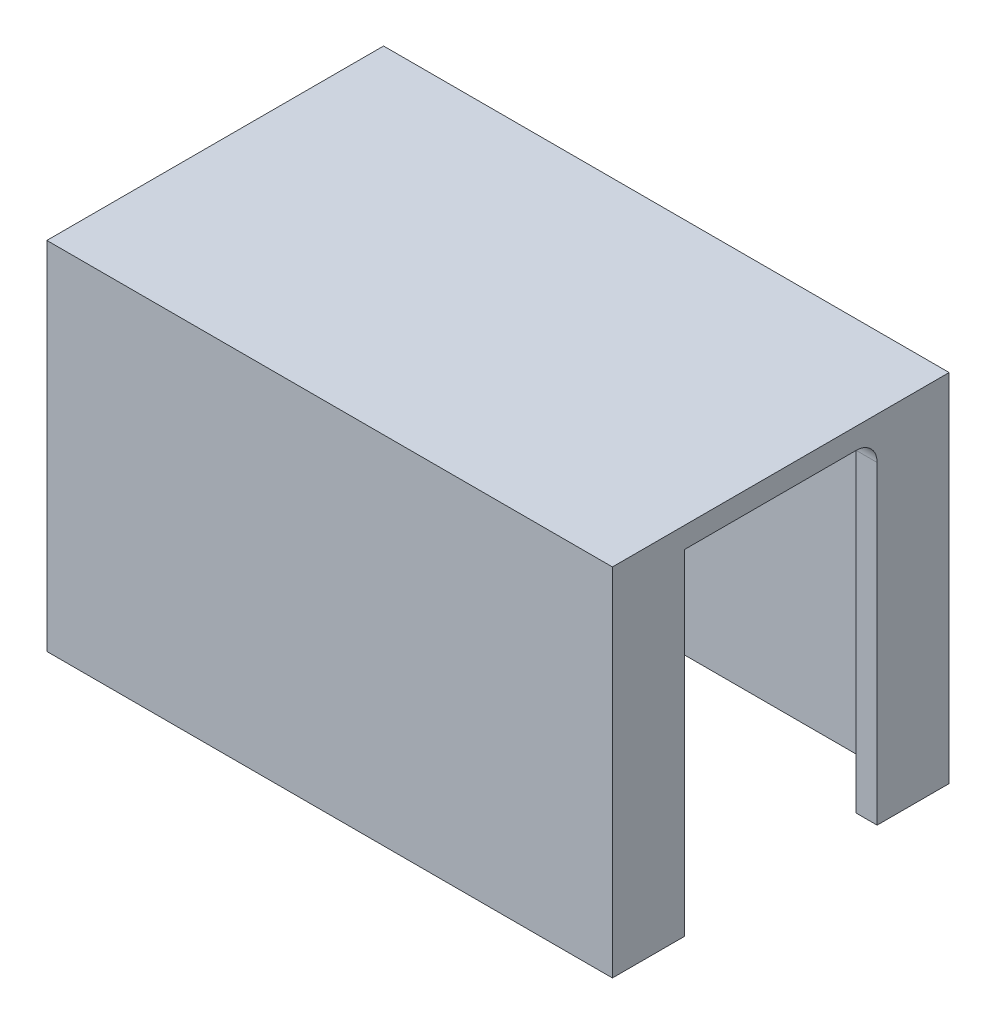
ISO-10303-21;
HEADER;
FILE_DESCRIPTION(('STEP AP214'),'2;1');
FILE_NAME('part.step','',(''),(''),'','','');
FILE_SCHEMA(('AUTOMOTIVE_DESIGN { 1 0 10303 214 1 1 1 1 }'));
ENDSEC;
DATA;
#1=APPLICATION_CONTEXT('core data for automotive mechanical design processes');
#2=APPLICATION_PROTOCOL_DEFINITION('international standard','automotive_design',2000,#1);
#3=PRODUCT_CONTEXT('',#1,'mechanical');
#4=PRODUCT('Part','Part','',(#3));
#5=PRODUCT_RELATED_PRODUCT_CATEGORY('part','',(#4));
#6=PRODUCT_DEFINITION_FORMATION('','',#4);
#7=PRODUCT_DEFINITION_CONTEXT('part definition',#1,'design');
#8=PRODUCT_DEFINITION('design','',#6,#7);
#9=PRODUCT_DEFINITION_SHAPE('','',#8);
#10=(LENGTH_UNIT() NAMED_UNIT(*) SI_UNIT(.MILLI.,.METRE.));
#11=(NAMED_UNIT(*) PLANE_ANGLE_UNIT() SI_UNIT($,.RADIAN.));
#12=(NAMED_UNIT(*) SI_UNIT($,.STERADIAN.) SOLID_ANGLE_UNIT());
#13=UNCERTAINTY_MEASURE_WITH_UNIT(LENGTH_MEASURE(1.E-05),#10,'distance_accuracy_value','');
#14=(GEOMETRIC_REPRESENTATION_CONTEXT(3) GLOBAL_UNCERTAINTY_ASSIGNED_CONTEXT((#13)) GLOBAL_UNIT_ASSIGNED_CONTEXT((#10,
#11,#12)) REPRESENTATION_CONTEXT('',''));
#15=CARTESIAN_POINT('',(0.,0.,0.));
#16=DIRECTION('',(0.,0.,1.));
#17=DIRECTION('',(1.,0.,0.));
#18=AXIS2_PLACEMENT_3D('',#15,#16,#17);
#19=CARTESIAN_POINT('',(85.7504,0.,40.132));
#20=DIRECTION('',(0.,0.,1.));
#21=DIRECTION('',(1.,0.,0.));
#22=AXIS2_PLACEMENT_3D('',#19,#20,#21);
#23=PLANE('',#22);
#24=DIRECTION('',(-1.,0.,0.));
#25=VECTOR('',#24,1.);
#26=CARTESIAN_POINT('',(85.7504,0.,40.132));
#27=LINE('',#26,#25);
#28=CARTESIAN_POINT('',(85.7504,0.,40.132));
#29=VERTEX_POINT('',#28);
#30=CARTESIAN_POINT('',(82.5754,0.,40.132));
#31=VERTEX_POINT('',#30);
#32=EDGE_CURVE('E252',#29,#31,#27,.T.);
#33=ORIENTED_EDGE('',*,*,#32,.T.);
#34=DIRECTION('',(0.,-1.,0.));
#35=VECTOR('',#34,1.);
#36=CARTESIAN_POINT('',(82.5754,50.8,40.132));
#37=LINE('',#36,#35);
#38=CARTESIAN_POINT('',(82.5754,50.8,40.132));
#39=VERTEX_POINT('',#38);
#40=EDGE_CURVE('E210',#39,#31,#37,.T.);
#41=ORIENTED_EDGE('',*,*,#40,.F.);
#42=DIRECTION('',(-1.,0.,0.));
#43=VECTOR('',#42,1.);
#44=CARTESIAN_POINT('',(85.7504,50.8,40.132));
#45=LINE('',#44,#43);
#46=CARTESIAN_POINT('',(85.7504,50.8,40.132));
#47=VERTEX_POINT('',#46);
#48=EDGE_CURVE('E200',#47,#39,#45,.T.);
#49=ORIENTED_EDGE('',*,*,#48,.F.);
#50=DIRECTION('',(0.,1.,0.));
#51=VECTOR('',#50,1.);
#52=CARTESIAN_POINT('',(85.7504,0.,40.132));
#53=LINE('',#52,#51);
#54=EDGE_CURVE('E230',#29,#47,#53,.T.);
#55=ORIENTED_EDGE('',*,*,#54,.F.);
#56=EDGE_LOOP('',(#33,#41,#49,#55));
#57=FACE_BOUND('',#56,.T.);
#58=ADVANCED_FACE('F37',(#57),#23,.F.);
#59=CARTESIAN_POINT('',(85.7504,50.8,10.922));
#60=DIRECTION('',(0.,0.,-1.));
#61=DIRECTION('',(-1.,0.,0.));
#62=AXIS2_PLACEMENT_3D('',#59,#60,#61);
#63=PLANE('',#62);
#64=DIRECTION('',(0.,-1.,0.));
#65=VECTOR('',#64,1.);
#66=CARTESIAN_POINT('',(85.7504,50.8,10.922));
#67=LINE('',#66,#65);
#68=CARTESIAN_POINT('',(85.7504,47.625,10.922));
#69=VERTEX_POINT('',#68);
#70=CARTESIAN_POINT('',(85.7504,0.,10.922));
#71=VERTEX_POINT('',#70);
#72=EDGE_CURVE('E236',#69,#71,#67,.T.);
#73=ORIENTED_EDGE('',*,*,#72,.F.);
#74=DIRECTION('',(-1.,0.,0.));
#75=VECTOR('',#74,1.);
#76=CARTESIAN_POINT('',(79.4004,47.625,10.922));
#77=LINE('',#76,#75);
#78=CARTESIAN_POINT('',(82.5754,47.625,10.922));
#79=VERTEX_POINT('',#78);
#80=EDGE_CURVE('E335',#69,#79,#77,.T.);
#81=ORIENTED_EDGE('',*,*,#80,.T.);
#82=DIRECTION('',(0.,1.,0.));
#83=VECTOR('',#82,1.);
#84=CARTESIAN_POINT('',(82.5754,0.,10.922));
#85=LINE('',#84,#83);
#86=CARTESIAN_POINT('',(82.5754,0.,10.922));
#87=VERTEX_POINT('',#86);
#88=EDGE_CURVE('E221',#87,#79,#85,.T.);
#89=ORIENTED_EDGE('',*,*,#88,.F.);
#90=DIRECTION('',(-1.,0.,0.));
#91=VECTOR('',#90,1.);
#92=CARTESIAN_POINT('',(85.7504,0.,10.922));
#93=LINE('',#92,#91);
#94=EDGE_CURVE('E245',#71,#87,#93,.T.);
#95=ORIENTED_EDGE('',*,*,#94,.F.);
#96=EDGE_LOOP('',(#73,#81,#89,#95));
#97=FACE_BOUND('',#96,.T.);
#98=ADVANCED_FACE('F354',(#97),#63,.F.);
#99=CARTESIAN_POINT('',(85.7504,0.,51.054));
#100=DIRECTION('',(0.,-1.,0.));
#101=DIRECTION('',(1.,0.,0.));
#102=AXIS2_PLACEMENT_3D('',#99,#100,#101);
#103=PLANE('',#102);
#104=DIRECTION('',(0.,0.,1.));
#105=VECTOR('',#104,1.);
#106=CARTESIAN_POINT('',(82.5754,0.,3.17499999999999));
#107=LINE('',#106,#105);
#108=CARTESIAN_POINT('',(82.5754,0.,6.34999999999999));
#109=VERTEX_POINT('',#108);
#110=EDGE_CURVE('E225',#109,#87,#107,.T.);
#111=ORIENTED_EDGE('',*,*,#110,.F.);
#112=CARTESIAN_POINT('',(79.4004,0.,6.34999999999999));
#113=DIRECTION('',(0.,-1.,0.));
#114=DIRECTION('',(1.,0.,0.));
#115=AXIS2_PLACEMENT_3D('',#112,#113,#114);
#116=CIRCLE('',#115,3.175);
#117=CARTESIAN_POINT('',(79.4004,0.,3.17499999999999));
#118=VERTEX_POINT('',#117);
#119=EDGE_CURVE('E333',#109,#118,#116,.F.);
#120=ORIENTED_EDGE('',*,*,#119,.T.);
#121=DIRECTION('',(1.,0.,0.));
#122=VECTOR('',#121,1.);
#123=CARTESIAN_POINT('',(3.175,0.,3.17499999999999));
#124=LINE('',#123,#122);
#125=CARTESIAN_POINT('',(6.35,0.,3.17499999999999));
#126=VERTEX_POINT('',#125);
#127=EDGE_CURVE('E217',#126,#118,#124,.T.);
#128=ORIENTED_EDGE('',*,*,#127,.F.);
#129=CARTESIAN_POINT('',(6.35,0.,6.34999999999999));
#130=DIRECTION('',(0.,-1.,0.));
#131=DIRECTION('',(1.,0.,0.));
#132=AXIS2_PLACEMENT_3D('',#129,#130,#131);
#133=CIRCLE('',#132,3.175);
#134=CARTESIAN_POINT('',(3.175,0.,6.34999999999999));
#135=VERTEX_POINT('',#134);
#136=EDGE_CURVE('E295',#126,#135,#133,.F.);
#137=ORIENTED_EDGE('',*,*,#136,.T.);
#138=DIRECTION('',(0.,0.,1.));
#139=VECTOR('',#138,1.);
#140=CARTESIAN_POINT('',(3.175,0.,3.17499999999999));
#141=LINE('',#140,#139);
#142=CARTESIAN_POINT('',(3.175,0.,10.922));
#143=VERTEX_POINT('',#142);
#144=EDGE_CURVE('E220',#135,#143,#141,.T.);
#145=ORIENTED_EDGE('',*,*,#144,.T.);
#146=CARTESIAN_POINT('',(0.,0.,10.922));
#147=VERTEX_POINT('',#146);
#148=EDGE_CURVE('E249',#143,#147,#93,.T.);
#149=ORIENTED_EDGE('',*,*,#148,.T.);
#150=DIRECTION('',(0.,0.,-1.));
#151=VECTOR('',#150,1.);
#152=CARTESIAN_POINT('',(0.,0.,51.054));
#153=LINE('',#152,#151);
#154=CARTESIAN_POINT('',(0.,0.,0.));
#155=VERTEX_POINT('',#154);
#156=EDGE_CURVE('E287',#147,#155,#153,.T.);
#157=ORIENTED_EDGE('',*,*,#156,.T.);
#158=DIRECTION('',(-1.,0.,0.));
#159=VECTOR('',#158,1.);
#160=CARTESIAN_POINT('',(85.7504,0.,0.));
#161=LINE('',#160,#159);
#162=CARTESIAN_POINT('',(85.7504,0.,0.));
#163=VERTEX_POINT('',#162);
#164=EDGE_CURVE('E271',#163,#155,#161,.T.);
#165=ORIENTED_EDGE('',*,*,#164,.F.);
#166=DIRECTION('',(0.,0.,-1.));
#167=VECTOR('',#166,1.);
#168=CARTESIAN_POINT('',(85.7504,0.,51.054));
#169=LINE('',#168,#167);
#170=EDGE_CURVE('E268',#71,#163,#169,.T.);
#171=ORIENTED_EDGE('',*,*,#170,.F.);
#172=ORIENTED_EDGE('',*,*,#94,.T.);
#173=EDGE_LOOP('',(#111,#120,#128,#137,#145,#149,#157,#165,#171,#172));
#174=FACE_BOUND('',#173,.T.);
#175=ADVANCED_FACE('F360',(#174),#103,.T.);
#176=CARTESIAN_POINT('',(85.7504,53.975,51.054));
#177=DIRECTION('',(1.,0.,0.));
#178=DIRECTION('',(0.,0.,-1.));
#179=AXIS2_PLACEMENT_3D('',#176,#177,#178);
#180=PLANE('',#179);
#181=DIRECTION('',(0.,0.,-1.));
#182=VECTOR('',#181,1.);
#183=CARTESIAN_POINT('',(85.7504,50.8,40.132));
#184=LINE('',#183,#182);
#185=CARTESIAN_POINT('',(85.7504,50.8,14.097));
#186=VERTEX_POINT('',#185);
#187=EDGE_CURVE('E233',#47,#186,#184,.T.);
#188=ORIENTED_EDGE('',*,*,#187,.T.);
#189=CARTESIAN_POINT('',(85.7504,47.625,14.097));
#190=DIRECTION('',(1.,0.,0.));
#191=DIRECTION('',(0.,0.,-1.));
#192=AXIS2_PLACEMENT_3D('',#189,#190,#191);
#193=CIRCLE('',#192,3.175);
#194=EDGE_CURVE('E11',#186,#69,#193,.F.);
#195=ORIENTED_EDGE('',*,*,#194,.T.);
#196=ORIENTED_EDGE('',*,*,#72,.T.);
#197=ORIENTED_EDGE('',*,*,#170,.T.);
#198=DIRECTION('',(0.,-1.,0.));
#199=VECTOR('',#198,1.);
#200=CARTESIAN_POINT('',(85.7504,53.975,0.));
#201=LINE('',#200,#199);
#202=CARTESIAN_POINT('',(85.7504,53.975,0.));
#203=VERTEX_POINT('',#202);
#204=EDGE_CURVE('E248',#203,#163,#201,.T.);
#205=ORIENTED_EDGE('',*,*,#204,.F.);
#206=DIRECTION('',(0.,0.,-1.));
#207=VECTOR('',#206,1.);
#208=CARTESIAN_POINT('',(85.7504,53.975,51.054));
#209=LINE('',#208,#207);
#210=CARTESIAN_POINT('',(85.7504,53.975,51.054));
#211=VERTEX_POINT('',#210);
#212=EDGE_CURVE('E279',#211,#203,#209,.T.);
#213=ORIENTED_EDGE('',*,*,#212,.F.);
#214=DIRECTION('',(0.,-1.,0.));
#215=VECTOR('',#214,1.);
#216=CARTESIAN_POINT('',(85.7504,53.975,51.054));
#217=LINE('',#216,#215);
#218=CARTESIAN_POINT('',(85.7504,0.,51.054));
#219=VERTEX_POINT('',#218);
#220=EDGE_CURVE('E255',#211,#219,#217,.T.);
#221=ORIENTED_EDGE('',*,*,#220,.T.);
#222=EDGE_CURVE('E288',#219,#29,#169,.T.);
#223=ORIENTED_EDGE('',*,*,#222,.T.);
#224=ORIENTED_EDGE('',*,*,#54,.T.);
#225=EDGE_LOOP('',(#188,#195,#196,#197,#205,#213,#221,#223,#224));
#226=FACE_BOUND('',#225,.T.);
#227=ADVANCED_FACE('F351',(#226),#180,.T.);
#228=CARTESIAN_POINT('',(0.,53.975,51.054));
#229=DIRECTION('',(0.,1.,0.));
#230=DIRECTION('',(-1.,0.,0.));
#231=AXIS2_PLACEMENT_3D('',#228,#229,#230);
#232=PLANE('',#231);
#233=DIRECTION('',(1.,0.,0.));
#234=VECTOR('',#233,1.);
#235=CARTESIAN_POINT('',(0.,53.975,0.));
#236=LINE('',#235,#234);
#237=CARTESIAN_POINT('',(0.,53.975,0.));
#238=VERTEX_POINT('',#237);
#239=EDGE_CURVE('E259',#238,#203,#236,.T.);
#240=ORIENTED_EDGE('',*,*,#239,.F.);
#241=DIRECTION('',(0.,0.,-1.));
#242=VECTOR('',#241,1.);
#243=CARTESIAN_POINT('',(0.,53.975,51.054));
#244=LINE('',#243,#242);
#245=CARTESIAN_POINT('',(0.,53.975,51.054));
#246=VERTEX_POINT('',#245);
#247=EDGE_CURVE('E282',#246,#238,#244,.T.);
#248=ORIENTED_EDGE('',*,*,#247,.F.);
#249=DIRECTION('',(1.,0.,0.));
#250=VECTOR('',#249,1.);
#251=CARTESIAN_POINT('',(0.,53.975,51.054));
#252=LINE('',#251,#250);
#253=EDGE_CURVE('E265',#246,#211,#252,.T.);
#254=ORIENTED_EDGE('',*,*,#253,.T.);
#255=ORIENTED_EDGE('',*,*,#212,.T.);
#256=EDGE_LOOP('',(#240,#248,#254,#255));
#257=FACE_BOUND('',#256,.T.);
#258=ADVANCED_FACE('F368',(#257),#232,.T.);
#259=CARTESIAN_POINT('',(0.,0.,51.054));
#260=DIRECTION('',(-1.,0.,0.));
#261=DIRECTION('',(0.,-1.,0.));
#262=AXIS2_PLACEMENT_3D('',#259,#260,#261);
#263=PLANE('',#262);
#264=DIRECTION('',(0.,-1.,0.));
#265=VECTOR('',#264,1.);
#266=CARTESIAN_POINT('',(0.,50.8,10.922));
#267=LINE('',#266,#265);
#268=CARTESIAN_POINT('',(0.,47.625,10.922));
#269=VERTEX_POINT('',#268);
#270=EDGE_CURVE('E234',#269,#147,#267,.T.);
#271=ORIENTED_EDGE('',*,*,#270,.F.);
#272=CARTESIAN_POINT('',(0.,47.625,14.097));
#273=DIRECTION('',(-1.,0.,0.));
#274=DIRECTION('',(0.,-1.,0.));
#275=AXIS2_PLACEMENT_3D('',#272,#273,#274);
#276=CIRCLE('',#275,3.175);
#277=CARTESIAN_POINT('',(0.,50.8,14.097));
#278=VERTEX_POINT('',#277);
#279=EDGE_CURVE('E320',#269,#278,#276,.F.);
#280=ORIENTED_EDGE('',*,*,#279,.T.);
#281=DIRECTION('',(0.,0.,-1.));
#282=VECTOR('',#281,1.);
#283=CARTESIAN_POINT('',(0.,50.8,40.132));
#284=LINE('',#283,#282);
#285=CARTESIAN_POINT('',(0.,50.8,40.132));
#286=VERTEX_POINT('',#285);
#287=EDGE_CURVE('E241',#286,#278,#284,.T.);
#288=ORIENTED_EDGE('',*,*,#287,.F.);
#289=DIRECTION('',(0.,1.,0.));
#290=VECTOR('',#289,1.);
#291=CARTESIAN_POINT('',(0.,0.,40.132));
#292=LINE('',#291,#290);
#293=CARTESIAN_POINT('',(0.,0.,40.132));
#294=VERTEX_POINT('',#293);
#295=EDGE_CURVE('E227',#294,#286,#292,.T.);
#296=ORIENTED_EDGE('',*,*,#295,.F.);
#297=CARTESIAN_POINT('',(0.,0.,51.054));
#298=VERTEX_POINT('',#297);
#299=EDGE_CURVE('E284',#298,#294,#153,.T.);
#300=ORIENTED_EDGE('',*,*,#299,.F.);
#301=DIRECTION('',(0.,1.,0.));
#302=VECTOR('',#301,1.);
#303=CARTESIAN_POINT('',(0.,0.,51.054));
#304=LINE('',#303,#302);
#305=EDGE_CURVE('E262',#298,#246,#304,.T.);
#306=ORIENTED_EDGE('',*,*,#305,.T.);
#307=ORIENTED_EDGE('',*,*,#247,.T.);
#308=DIRECTION('',(0.,1.,0.));
#309=VECTOR('',#308,1.);
#310=CARTESIAN_POINT('',(0.,0.,0.));
#311=LINE('',#310,#309);
#312=EDGE_CURVE('E274',#155,#238,#311,.T.);
#313=ORIENTED_EDGE('',*,*,#312,.F.);
#314=ORIENTED_EDGE('',*,*,#156,.F.);
#315=EDGE_LOOP('',(#271,#280,#288,#296,#300,#306,#307,#313,#314));
#316=FACE_BOUND('',#315,.T.);
#317=ADVANCED_FACE('F409',(#316),#263,.T.);
#318=DIRECTION('',(0.,0.,1.));
#319=VECTOR('',#318,1.);
#320=CARTESIAN_POINT('',(82.5754,0.,40.132));
#321=LINE('',#320,#319);
#322=CARTESIAN_POINT('',(82.5754,0.,47.879));
#323=VERTEX_POINT('',#322);
#324=EDGE_CURVE('E186',#31,#323,#321,.T.);
#325=ORIENTED_EDGE('',*,*,#324,.F.);
#326=ORIENTED_EDGE('',*,*,#32,.F.);
#327=ORIENTED_EDGE('',*,*,#222,.F.);
#328=DIRECTION('',(-1.,0.,0.));
#329=VECTOR('',#328,1.);
#330=CARTESIAN_POINT('',(85.7504,0.,51.054));
#331=LINE('',#330,#329);
#332=EDGE_CURVE('E258',#219,#298,#331,.T.);
#333=ORIENTED_EDGE('',*,*,#332,.T.);
#334=ORIENTED_EDGE('',*,*,#299,.T.);
#335=CARTESIAN_POINT('',(3.175,0.,40.132));
#336=VERTEX_POINT('',#335);
#337=EDGE_CURVE('E238',#336,#294,#27,.T.);
#338=ORIENTED_EDGE('',*,*,#337,.F.);
#339=DIRECTION('',(0.,0.,-1.));
#340=VECTOR('',#339,1.);
#341=CARTESIAN_POINT('',(3.17499999999999,0.,47.879));
#342=LINE('',#341,#340);
#343=CARTESIAN_POINT('',(3.17499999999999,0.,47.879));
#344=VERTEX_POINT('',#343);
#345=EDGE_CURVE('E201',#344,#336,#342,.T.);
#346=ORIENTED_EDGE('',*,*,#345,.F.);
#347=DIRECTION('',(-1.,0.,0.));
#348=VECTOR('',#347,1.);
#349=CARTESIAN_POINT('',(82.5754,0.,47.879));
#350=LINE('',#349,#348);
#351=EDGE_CURVE('E203',#323,#344,#350,.T.);
#352=ORIENTED_EDGE('',*,*,#351,.F.);
#353=EDGE_LOOP('',(#325,#326,#327,#333,#334,#338,#346,#352));
#354=FACE_BOUND('',#353,.T.);
#355=ADVANCED_FACE('F376',(#354),#103,.T.);
#356=CARTESIAN_POINT('',(0.,0.,51.054));
#357=DIRECTION('',(0.,0.,-1.));
#358=DIRECTION('',(-1.,0.,0.));
#359=AXIS2_PLACEMENT_3D('',#356,#357,#358);
#360=PLANE('',#359);
#361=ORIENTED_EDGE('',*,*,#220,.F.);
#362=ORIENTED_EDGE('',*,*,#253,.F.);
#363=ORIENTED_EDGE('',*,*,#305,.F.);
#364=ORIENTED_EDGE('',*,*,#332,.F.);
#365=EDGE_LOOP('',(#361,#362,#363,#364));
#366=FACE_BOUND('',#365,.T.);
#367=ADVANCED_FACE('F372',(#366),#360,.F.);
#368=CARTESIAN_POINT('',(0.,0.,0.));
#369=DIRECTION('',(0.,0.,-1.));
#370=DIRECTION('',(-1.,0.,0.));
#371=AXIS2_PLACEMENT_3D('',#368,#369,#370);
#372=PLANE('',#371);
#373=ORIENTED_EDGE('',*,*,#204,.T.);
#374=ORIENTED_EDGE('',*,*,#164,.T.);
#375=ORIENTED_EDGE('',*,*,#312,.T.);
#376=ORIENTED_EDGE('',*,*,#239,.T.);
#377=EDGE_LOOP('',(#373,#374,#375,#376));
#378=FACE_BOUND('',#377,.T.);
#379=ADVANCED_FACE('F365',(#378),#372,.T.);
#380=DIRECTION('',(0.,-1.,0.));
#381=VECTOR('',#380,1.);
#382=CARTESIAN_POINT('',(3.175,50.8,10.922));
#383=LINE('',#382,#381);
#384=CARTESIAN_POINT('',(3.175,47.625,10.922));
#385=VERTEX_POINT('',#384);
#386=EDGE_CURVE('E212',#385,#143,#383,.T.);
#387=ORIENTED_EDGE('',*,*,#386,.F.);
#388=DIRECTION('',(-1.,0.,0.));
#389=VECTOR('',#388,1.);
#390=CARTESIAN_POINT('',(0.,47.625,10.922));
#391=LINE('',#390,#389);
#392=EDGE_CURVE('E308',#385,#269,#391,.T.);
#393=ORIENTED_EDGE('',*,*,#392,.T.);
#394=ORIENTED_EDGE('',*,*,#270,.T.);
#395=ORIENTED_EDGE('',*,*,#148,.F.);
#396=EDGE_LOOP('',(#387,#393,#394,#395));
#397=FACE_BOUND('',#396,.T.);
#398=ADVANCED_FACE('F385',(#397),#63,.F.);
#399=CARTESIAN_POINT('',(85.7504,50.8,40.132));
#400=DIRECTION('',(0.,1.,0.));
#401=DIRECTION('',(-1.,0.,0.));
#402=AXIS2_PLACEMENT_3D('',#399,#400,#401);
#403=PLANE('',#402);
#404=DIRECTION('',(0.,0.,1.));
#405=VECTOR('',#404,1.);
#406=CARTESIAN_POINT('',(79.4004,50.8,10.922));
#407=LINE('',#406,#405);
#408=CARTESIAN_POINT('',(79.4004,50.8,6.34999999999999));
#409=VERTEX_POINT('',#408);
#410=CARTESIAN_POINT('',(79.4004,50.8,14.097));
#411=VERTEX_POINT('',#410);
#412=EDGE_CURVE('E52',#409,#411,#407,.T.);
#413=ORIENTED_EDGE('',*,*,#412,.T.);
#414=DIRECTION('',(-1.,0.,0.));
#415=VECTOR('',#414,1.);
#416=CARTESIAN_POINT('',(85.7504,50.8,14.097));
#417=LINE('',#416,#415);
#418=EDGE_CURVE('E57',#411,#186,#417,.F.);
#419=ORIENTED_EDGE('',*,*,#418,.T.);
#420=ORIENTED_EDGE('',*,*,#187,.F.);
#421=ORIENTED_EDGE('',*,*,#48,.T.);
#422=DIRECTION('',(0.,0.,1.));
#423=VECTOR('',#422,1.);
#424=CARTESIAN_POINT('',(82.5754,50.8,40.132));
#425=LINE('',#424,#423);
#426=CARTESIAN_POINT('',(82.5754,50.8,47.879));
#427=VERTEX_POINT('',#426);
#428=EDGE_CURVE('E183',#39,#427,#425,.T.);
#429=ORIENTED_EDGE('',*,*,#428,.T.);
#430=DIRECTION('',(-1.,0.,0.));
#431=VECTOR('',#430,1.);
#432=CARTESIAN_POINT('',(82.5754,50.8,47.879));
#433=LINE('',#432,#431);
#434=CARTESIAN_POINT('',(3.17499999999999,50.8,47.879));
#435=VERTEX_POINT('',#434);
#436=EDGE_CURVE('E194',#427,#435,#433,.T.);
#437=ORIENTED_EDGE('',*,*,#436,.T.);
#438=DIRECTION('',(0.,0.,-1.));
#439=VECTOR('',#438,1.);
#440=CARTESIAN_POINT('',(3.17499999999999,50.8,47.879));
#441=LINE('',#440,#439);
#442=CARTESIAN_POINT('',(3.175,50.8,40.132));
#443=VERTEX_POINT('',#442);
#444=EDGE_CURVE('E191',#435,#443,#441,.T.);
#445=ORIENTED_EDGE('',*,*,#444,.T.);
#446=EDGE_CURVE('E251',#443,#286,#45,.T.);
#447=ORIENTED_EDGE('',*,*,#446,.T.);
#448=ORIENTED_EDGE('',*,*,#287,.T.);
#449=DIRECTION('',(-1.,0.,0.));
#450=VECTOR('',#449,1.);
#451=CARTESIAN_POINT('',(6.34999999999999,50.8,14.097));
#452=LINE('',#451,#450);
#453=CARTESIAN_POINT('',(6.35,50.8,14.097));
#454=VERTEX_POINT('',#453);
#455=EDGE_CURVE('E317',#278,#454,#452,.F.);
#456=ORIENTED_EDGE('',*,*,#455,.T.);
#457=DIRECTION('',(0.,0.,1.));
#458=VECTOR('',#457,1.);
#459=CARTESIAN_POINT('',(6.35,50.8,6.34999999999999));
#460=LINE('',#459,#458);
#461=CARTESIAN_POINT('',(6.35,50.8,6.34999999999999));
#462=VERTEX_POINT('',#461);
#463=EDGE_CURVE('E299',#454,#462,#460,.F.);
#464=ORIENTED_EDGE('',*,*,#463,.T.);
#465=DIRECTION('',(-1.,0.,0.));
#466=VECTOR('',#465,1.);
#467=CARTESIAN_POINT('',(85.7504,50.8,6.34999999999999));
#468=LINE('',#467,#466);
#469=EDGE_CURVE('E301',#462,#409,#468,.F.);
#470=ORIENTED_EDGE('',*,*,#469,.T.);
#471=EDGE_LOOP('',(#413,#419,#420,#421,#429,#437,#445,#447,#448,#456,#464,#470));
#472=FACE_BOUND('',#471,.T.);
#473=ADVANCED_FACE('F199',(#472),#403,.F.);
#474=ORIENTED_EDGE('',*,*,#446,.F.);
#475=DIRECTION('',(0.,-1.,0.));
#476=VECTOR('',#475,1.);
#477=CARTESIAN_POINT('',(3.175,50.8,40.132));
#478=LINE('',#477,#476);
#479=EDGE_CURVE('E213',#443,#336,#478,.T.);
#480=ORIENTED_EDGE('',*,*,#479,.T.);
#481=ORIENTED_EDGE('',*,*,#337,.T.);
#482=ORIENTED_EDGE('',*,*,#295,.T.);
#483=EDGE_LOOP('',(#474,#480,#481,#482));
#484=FACE_BOUND('',#483,.T.);
#485=ADVANCED_FACE('F380',(#484),#23,.F.);
#486=CARTESIAN_POINT('',(82.5754,0.,3.17499999999999));
#487=DIRECTION('',(1.,0.,0.));
#488=DIRECTION('',(0.,0.,-1.));
#489=AXIS2_PLACEMENT_3D('',#486,#487,#488);
#490=PLANE('',#489);
#491=ORIENTED_EDGE('',*,*,#88,.T.);
#492=DIRECTION('',(0.,0.,1.));
#493=VECTOR('',#492,1.);
#494=CARTESIAN_POINT('',(82.5754,47.625,6.34999999999999));
#495=LINE('',#494,#493);
#496=CARTESIAN_POINT('',(82.5754,47.625,6.34999999999999));
#497=VERTEX_POINT('',#496);
#498=EDGE_CURVE('E327',#79,#497,#495,.F.);
#499=ORIENTED_EDGE('',*,*,#498,.T.);
#500=DIRECTION('',(0.,1.,0.));
#501=VECTOR('',#500,1.);
#502=CARTESIAN_POINT('',(82.5754,0.,6.34999999999999));
#503=LINE('',#502,#501);
#504=EDGE_CURVE('E325',#497,#109,#503,.F.);
#505=ORIENTED_EDGE('',*,*,#504,.T.);
#506=ORIENTED_EDGE('',*,*,#110,.T.);
#507=EDGE_LOOP('',(#491,#499,#505,#506));
#508=FACE_BOUND('',#507,.T.);
#509=ADVANCED_FACE('F389',(#508),#490,.F.);
#510=CARTESIAN_POINT('',(3.175,50.8,3.17499999999999));
#511=DIRECTION('',(-1.,0.,0.));
#512=DIRECTION('',(0.,-1.,0.));
#513=AXIS2_PLACEMENT_3D('',#510,#511,#512);
#514=PLANE('',#513);
#515=DIRECTION('',(0.,-1.,0.));
#516=VECTOR('',#515,1.);
#517=CARTESIAN_POINT('',(3.175,50.8,6.34999999999999));
#518=LINE('',#517,#516);
#519=CARTESIAN_POINT('',(3.175,47.625,6.34999999999999));
#520=VERTEX_POINT('',#519);
#521=EDGE_CURVE('E292',#135,#520,#518,.F.);
#522=ORIENTED_EDGE('',*,*,#521,.T.);
#523=DIRECTION('',(0.,0.,1.));
#524=VECTOR('',#523,1.);
#525=CARTESIAN_POINT('',(3.175,47.625,10.922));
#526=LINE('',#525,#524);
#527=EDGE_CURVE('E305',#520,#385,#526,.T.);
#528=ORIENTED_EDGE('',*,*,#527,.T.);
#529=ORIENTED_EDGE('',*,*,#386,.T.);
#530=ORIENTED_EDGE('',*,*,#144,.F.);
#531=EDGE_LOOP('',(#522,#528,#529,#530));
#532=FACE_BOUND('',#531,.T.);
#533=ADVANCED_FACE('F395',(#532),#514,.F.);
#534=CARTESIAN_POINT('',(0.,0.,3.17499999999999));
#535=DIRECTION('',(0.,0.,1.));
#536=DIRECTION('',(1.,0.,0.));
#537=AXIS2_PLACEMENT_3D('',#534,#535,#536);
#538=PLANE('',#537);
#539=ORIENTED_EDGE('',*,*,#127,.T.);
#540=DIRECTION('',(0.,1.,0.));
#541=VECTOR('',#540,1.);
#542=CARTESIAN_POINT('',(79.4004,0.,3.17499999999999));
#543=LINE('',#542,#541);
#544=CARTESIAN_POINT('',(79.4004,47.625,3.17499999999999));
#545=VERTEX_POINT('',#544);
#546=EDGE_CURVE('E331',#118,#545,#543,.T.);
#547=ORIENTED_EDGE('',*,*,#546,.T.);
#548=DIRECTION('',(-1.,0.,0.));
#549=VECTOR('',#548,1.);
#550=CARTESIAN_POINT('',(0.,47.625,3.17499999999999));
#551=LINE('',#550,#549);
#552=CARTESIAN_POINT('',(6.35,47.625,3.17499999999999));
#553=VERTEX_POINT('',#552);
#554=EDGE_CURVE('E297',#545,#553,#551,.T.);
#555=ORIENTED_EDGE('',*,*,#554,.T.);
#556=DIRECTION('',(0.,-1.,0.));
#557=VECTOR('',#556,1.);
#558=CARTESIAN_POINT('',(6.35,0.,3.17499999999999));
#559=LINE('',#558,#557);
#560=EDGE_CURVE('E281',#553,#126,#559,.T.);
#561=ORIENTED_EDGE('',*,*,#560,.T.);
#562=EDGE_LOOP('',(#539,#547,#555,#561));
#563=FACE_BOUND('',#562,.T.);
#564=ADVANCED_FACE('F450',(#563),#538,.T.);
#565=CARTESIAN_POINT('',(82.5754,50.8,40.132));
#566=DIRECTION('',(1.,0.,0.));
#567=DIRECTION('',(0.,1.,0.));
#568=AXIS2_PLACEMENT_3D('',#565,#566,#567);
#569=PLANE('',#568);
#570=ORIENTED_EDGE('',*,*,#324,.T.);
#571=DIRECTION('',(0.,-1.,0.));
#572=VECTOR('',#571,1.);
#573=CARTESIAN_POINT('',(82.5754,50.8,47.879));
#574=LINE('',#573,#572);
#575=EDGE_CURVE('E179',#427,#323,#574,.T.);
#576=ORIENTED_EDGE('',*,*,#575,.F.);
#577=ORIENTED_EDGE('',*,*,#428,.F.);
#578=ORIENTED_EDGE('',*,*,#40,.T.);
#579=EDGE_LOOP('',(#570,#576,#577,#578));
#580=FACE_BOUND('',#579,.T.);
#581=ADVANCED_FACE('F181',(#580),#569,.F.);
#582=CARTESIAN_POINT('',(3.17499999999999,50.8,47.879));
#583=DIRECTION('',(-1.,0.,0.));
#584=DIRECTION('',(0.,0.,1.));
#585=AXIS2_PLACEMENT_3D('',#582,#583,#584);
#586=PLANE('',#585);
#587=ORIENTED_EDGE('',*,*,#345,.T.);
#588=ORIENTED_EDGE('',*,*,#479,.F.);
#589=ORIENTED_EDGE('',*,*,#444,.F.);
#590=DIRECTION('',(0.,-1.,0.));
#591=VECTOR('',#590,1.);
#592=CARTESIAN_POINT('',(3.17499999999999,50.8,47.879));
#593=LINE('',#592,#591);
#594=EDGE_CURVE('E190',#435,#344,#593,.T.);
#595=ORIENTED_EDGE('',*,*,#594,.T.);
#596=EDGE_LOOP('',(#587,#588,#589,#595));
#597=FACE_BOUND('',#596,.T.);
#598=ADVANCED_FACE('F405',(#597),#586,.F.);
#599=CARTESIAN_POINT('',(82.5754,50.8,47.879));
#600=DIRECTION('',(0.,0.,1.));
#601=DIRECTION('',(1.,0.,0.));
#602=AXIS2_PLACEMENT_3D('',#599,#600,#601);
#603=PLANE('',#602);
#604=ORIENTED_EDGE('',*,*,#351,.T.);
#605=ORIENTED_EDGE('',*,*,#594,.F.);
#606=ORIENTED_EDGE('',*,*,#436,.F.);
#607=ORIENTED_EDGE('',*,*,#575,.T.);
#608=EDGE_LOOP('',(#604,#605,#606,#607));
#609=FACE_BOUND('',#608,.T.);
#610=ADVANCED_FACE('F195',(#609),#603,.F.);
#611=CARTESIAN_POINT('',(6.35,0.,6.34999999999999));
#612=DIRECTION('',(0.,-1.,0.));
#613=DIRECTION('',(1.,0.,0.));
#614=AXIS2_PLACEMENT_3D('',#611,#612,#613);
#615=CYLINDRICAL_SURFACE('',#614,3.175);
#616=ORIENTED_EDGE('',*,*,#560,.F.);
#617=CARTESIAN_POINT('',(6.35,47.625,6.34999999999999));
#618=DIRECTION('',(0.,-1.,0.));
#619=DIRECTION('',(1.,0.,0.));
#620=AXIS2_PLACEMENT_3D('',#617,#618,#619);
#621=CIRCLE('',#620,3.175);
#622=EDGE_CURVE('E303',#553,#520,#621,.F.);
#623=ORIENTED_EDGE('',*,*,#622,.T.);
#624=ORIENTED_EDGE('',*,*,#521,.F.);
#625=ORIENTED_EDGE('',*,*,#136,.F.);
#626=EDGE_LOOP('',(#616,#623,#624,#625));
#627=FACE_BOUND('',#626,.T.);
#628=ADVANCED_FACE('F427',(#627),#615,.F.);
#629=CARTESIAN_POINT('',(6.35,47.625,3.17499999999999));
#630=DIRECTION('',(0.,0.,-1.));
#631=DIRECTION('',(-1.,0.,0.));
#632=AXIS2_PLACEMENT_3D('',#629,#630,#631);
#633=CYLINDRICAL_SURFACE('',#632,3.175);
#634=ORIENTED_EDGE('',*,*,#463,.F.);
#635=CARTESIAN_POINT('',(6.35,47.625,14.097));
#636=DIRECTION('',(0.707106781186547,0.,-0.707106781186547));
#637=DIRECTION('',(-0.707106781186547,0.,-0.707106781186547));
#638=AXIS2_PLACEMENT_3D('',#635,#636,#637);
#639=ELLIPSE('',#638,4.49012806053458,3.175);
#640=EDGE_CURVE('E322',#454,#385,#639,.F.);
#641=ORIENTED_EDGE('',*,*,#640,.T.);
#642=ORIENTED_EDGE('',*,*,#527,.F.);
#643=CARTESIAN_POINT('',(6.35,47.625,6.34999999999999));
#644=DIRECTION('',(0.,0.,1.));
#645=DIRECTION('',(1.,0.,0.));
#646=AXIS2_PLACEMENT_3D('',#643,#644,#645);
#647=CIRCLE('',#646,3.175);
#648=EDGE_CURVE('E208',#462,#520,#647,.T.);
#649=ORIENTED_EDGE('',*,*,#648,.F.);
#650=EDGE_LOOP('',(#634,#641,#642,#649));
#651=FACE_BOUND('',#650,.T.);
#652=ADVANCED_FACE('F431',(#651),#633,.F.);
#653=CARTESIAN_POINT('',(6.35,47.625,6.34999999999999));
#654=DIRECTION('',(0.,1.,0.));
#655=DIRECTION('',(-1.,0.,0.));
#656=AXIS2_PLACEMENT_3D('',#653,#654,#655);
#657=SPHERICAL_SURFACE('',#656,3.175);
#658=ORIENTED_EDGE('',*,*,#648,.T.);
#659=ORIENTED_EDGE('',*,*,#622,.F.);
#660=CARTESIAN_POINT('',(6.35,47.625,6.34999999999999));
#661=DIRECTION('',(-1.,0.,0.));
#662=DIRECTION('',(0.,-1.,0.));
#663=AXIS2_PLACEMENT_3D('',#660,#661,#662);
#664=CIRCLE('',#663,3.175);
#665=EDGE_CURVE('E309',#462,#553,#664,.T.);
#666=ORIENTED_EDGE('',*,*,#665,.F.);
#667=EDGE_LOOP('',(#658,#659,#666));
#668=FACE_BOUND('',#667,.T.);
#669=ADVANCED_FACE('F435',(#668),#657,.F.);
#670=CARTESIAN_POINT('',(0.,47.625,6.34999999999999));
#671=DIRECTION('',(-1.,0.,0.));
#672=DIRECTION('',(0.,-1.,0.));
#673=AXIS2_PLACEMENT_3D('',#670,#671,#672);
#674=CYLINDRICAL_SURFACE('',#673,3.175);
#675=ORIENTED_EDGE('',*,*,#554,.F.);
#676=CARTESIAN_POINT('',(79.4004,47.625,6.34999999999999));
#677=DIRECTION('',(-1.,0.,0.));
#678=DIRECTION('',(0.,-1.,0.));
#679=AXIS2_PLACEMENT_3D('',#676,#677,#678);
#680=CIRCLE('',#679,3.175);
#681=EDGE_CURVE('E329',#545,#409,#680,.F.);
#682=ORIENTED_EDGE('',*,*,#681,.T.);
#683=ORIENTED_EDGE('',*,*,#469,.F.);
#684=ORIENTED_EDGE('',*,*,#665,.T.);
#685=EDGE_LOOP('',(#675,#682,#683,#684));
#686=FACE_BOUND('',#685,.T.);
#687=ADVANCED_FACE('F438',(#686),#674,.F.);
#688=CARTESIAN_POINT('',(85.7504,47.625,14.097));
#689=DIRECTION('',(1.,0.,0.));
#690=DIRECTION('',(0.,1.,0.));
#691=AXIS2_PLACEMENT_3D('',#688,#689,#690);
#692=CYLINDRICAL_SURFACE('',#691,3.175);
#693=ORIENTED_EDGE('',*,*,#640,.F.);
#694=ORIENTED_EDGE('',*,*,#455,.F.);
#695=ORIENTED_EDGE('',*,*,#279,.F.);
#696=ORIENTED_EDGE('',*,*,#392,.F.);
#697=EDGE_LOOP('',(#693,#694,#695,#696));
#698=FACE_BOUND('',#697,.T.);
#699=ADVANCED_FACE('F414',(#698),#692,.F.);
#700=CARTESIAN_POINT('',(79.4004,0.,6.34999999999999));
#701=DIRECTION('',(0.,1.,0.));
#702=DIRECTION('',(0.,0.,1.));
#703=AXIS2_PLACEMENT_3D('',#700,#701,#702);
#704=CYLINDRICAL_SURFACE('',#703,3.175);
#705=CARTESIAN_POINT('',(79.4004,47.625,6.34999999999999));
#706=DIRECTION('',(0.,-1.,0.));
#707=DIRECTION('',(0.,0.,-1.));
#708=AXIS2_PLACEMENT_3D('',#705,#706,#707);
#709=CIRCLE('',#708,3.175);
#710=EDGE_CURVE('E312',#545,#497,#709,.T.);
#711=ORIENTED_EDGE('',*,*,#710,.F.);
#712=ORIENTED_EDGE('',*,*,#546,.F.);
#713=ORIENTED_EDGE('',*,*,#119,.F.);
#714=ORIENTED_EDGE('',*,*,#504,.F.);
#715=EDGE_LOOP('',(#711,#712,#713,#714));
#716=FACE_BOUND('',#715,.T.);
#717=ADVANCED_FACE('F447',(#716),#704,.F.);
#718=CARTESIAN_POINT('',(79.4004,47.625,6.34999999999999));
#719=DIRECTION('',(1.,0.,0.));
#720=DIRECTION('',(0.,0.,-1.));
#721=AXIS2_PLACEMENT_3D('',#718,#719,#720);
#722=SPHERICAL_SURFACE('',#721,3.175);
#723=ORIENTED_EDGE('',*,*,#681,.F.);
#724=ORIENTED_EDGE('',*,*,#710,.T.);
#725=CARTESIAN_POINT('',(79.4004,47.625,6.34999999999999));
#726=DIRECTION('',(0.,0.,-1.));
#727=DIRECTION('',(0.,1.,0.));
#728=AXIS2_PLACEMENT_3D('',#725,#726,#727);
#729=CIRCLE('',#728,3.175);
#730=EDGE_CURVE('E336',#409,#497,#729,.T.);
#731=ORIENTED_EDGE('',*,*,#730,.F.);
#732=EDGE_LOOP('',(#723,#724,#731));
#733=FACE_BOUND('',#732,.T.);
#734=ADVANCED_FACE('F443',(#733),#722,.F.);
#735=CARTESIAN_POINT('',(79.4004,47.625,40.132));
#736=DIRECTION('',(0.,0.,-1.));
#737=DIRECTION('',(-1.,0.,0.));
#738=AXIS2_PLACEMENT_3D('',#735,#736,#737);
#739=CYLINDRICAL_SURFACE('',#738,3.175);
#740=ORIENTED_EDGE('',*,*,#730,.T.);
#741=ORIENTED_EDGE('',*,*,#498,.F.);
#742=CARTESIAN_POINT('',(79.4004,47.625,14.097));
#743=DIRECTION('',(-0.707106781186547,0.,-0.707106781186547));
#744=DIRECTION('',(0.707106781186547,0.,-0.707106781186547));
#745=AXIS2_PLACEMENT_3D('',#742,#743,#744);
#746=ELLIPSE('',#745,4.49012806053458,3.175);
#747=EDGE_CURVE('E45',#79,#411,#746,.F.);
#748=ORIENTED_EDGE('',*,*,#747,.T.);
#749=ORIENTED_EDGE('',*,*,#412,.F.);
#750=EDGE_LOOP('',(#740,#741,#748,#749));
#751=FACE_BOUND('',#750,.T.);
#752=ADVANCED_FACE('F345',(#751),#739,.F.);
#753=CARTESIAN_POINT('',(85.7504,47.625,14.097));
#754=DIRECTION('',(1.,0.,0.));
#755=DIRECTION('',(0.,1.,0.));
#756=AXIS2_PLACEMENT_3D('',#753,#754,#755);
#757=CYLINDRICAL_SURFACE('',#756,3.175);
#758=ORIENTED_EDGE('',*,*,#194,.F.);
#759=ORIENTED_EDGE('',*,*,#418,.F.);
#760=ORIENTED_EDGE('',*,*,#747,.F.);
#761=ORIENTED_EDGE('',*,*,#80,.F.);
#762=EDGE_LOOP('',(#758,#759,#760,#761));
#763=FACE_BOUND('',#762,.T.);
#764=ADVANCED_FACE('F39',(#763),#757,.F.);
#765=CLOSED_SHELL('',(#58,#98,#175,#227,#258,#317,#355,#367,#379,#398,#473,#485,#509,#533,#564,
#581,#598,#610,#628,#652,#669,#687,#699,#717,#734,#752,#764));
#766=MANIFOLD_SOLID_BREP('B2',#765);
#767=ADVANCED_BREP_SHAPE_REPRESENTATION('',(#18,#766),#14);
#768=SHAPE_DEFINITION_REPRESENTATION(#9,#767);
ENDSEC;
END-ISO-10303-21;
